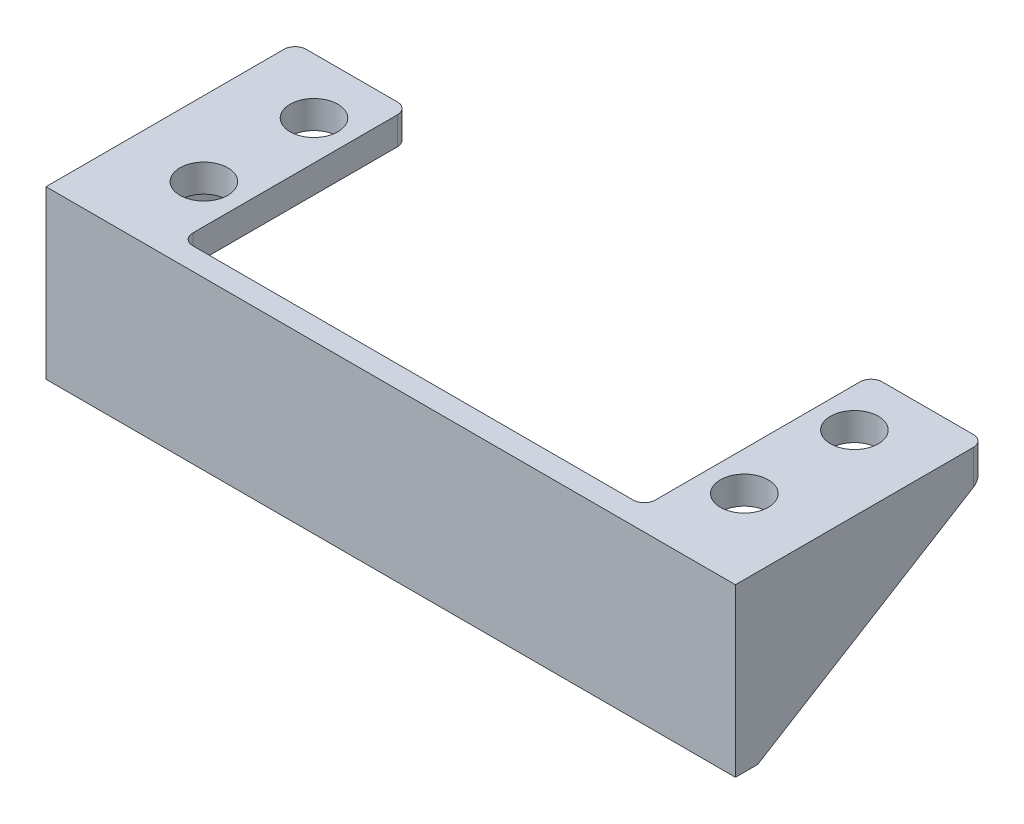
ISO-10303-21;
HEADER;
FILE_DESCRIPTION(('STEP AP214'),'2;1');
FILE_NAME('part.step','',(''),(''),'','','');
FILE_SCHEMA(('AUTOMOTIVE_DESIGN { 1 0 10303 214 1 1 1 1 }'));
ENDSEC;
DATA;
#1=APPLICATION_CONTEXT('core data for automotive mechanical design processes');
#2=APPLICATION_PROTOCOL_DEFINITION('international standard','automotive_design',2000,#1);
#3=PRODUCT_CONTEXT('',#1,'mechanical');
#4=PRODUCT('Part','Part','',(#3));
#5=PRODUCT_RELATED_PRODUCT_CATEGORY('part','',(#4));
#6=PRODUCT_DEFINITION_FORMATION('','',#4);
#7=PRODUCT_DEFINITION_CONTEXT('part definition',#1,'design');
#8=PRODUCT_DEFINITION('design','',#6,#7);
#9=PRODUCT_DEFINITION_SHAPE('','',#8);
#10=(LENGTH_UNIT() NAMED_UNIT(*) SI_UNIT(.MILLI.,.METRE.));
#11=(NAMED_UNIT(*) PLANE_ANGLE_UNIT() SI_UNIT($,.RADIAN.));
#12=(NAMED_UNIT(*) SI_UNIT($,.STERADIAN.) SOLID_ANGLE_UNIT());
#13=UNCERTAINTY_MEASURE_WITH_UNIT(LENGTH_MEASURE(1.E-05),#10,'distance_accuracy_value','');
#14=(GEOMETRIC_REPRESENTATION_CONTEXT(3) GLOBAL_UNCERTAINTY_ASSIGNED_CONTEXT((#13)) GLOBAL_UNIT_ASSIGNED_CONTEXT((#10,
#11,#12)) REPRESENTATION_CONTEXT('',''));
#15=CARTESIAN_POINT('',(0.,0.,0.));
#16=DIRECTION('',(0.,0.,1.));
#17=DIRECTION('',(1.,0.,0.));
#18=AXIS2_PLACEMENT_3D('',#15,#16,#17);
#19=CARTESIAN_POINT('',(0.,0.,0.));
#20=DIRECTION('',(0.,0.,1.));
#21=DIRECTION('',(1.,0.,0.));
#22=AXIS2_PLACEMENT_3D('',#19,#20,#21);
#23=PLANE('',#22);
#24=DIRECTION('',(1.,0.,0.));
#25=VECTOR('',#24,1.);
#26=CARTESIAN_POINT('',(29.,11.5,0.));
#27=LINE('',#26,#25);
#28=CARTESIAN_POINT('',(19.8,11.5,0.));
#29=VERTEX_POINT('',#28);
#30=CARTESIAN_POINT('',(28.,11.5,0.));
#31=VERTEX_POINT('',#30);
#32=EDGE_CURVE('E358',#29,#31,#27,.T.);
#33=ORIENTED_EDGE('',*,*,#32,.T.);
#34=DIRECTION('',(0.,-1.,0.));
#35=VECTOR('',#34,1.);
#36=CARTESIAN_POINT('',(28.,0.,0.));
#37=LINE('',#36,#35);
#38=CARTESIAN_POINT('',(28.,0.,0.));
#39=VERTEX_POINT('',#38);
#40=EDGE_CURVE('E360',#31,#39,#37,.T.);
#41=ORIENTED_EDGE('',*,*,#40,.T.);
#42=DIRECTION('',(1.,0.,0.));
#43=VECTOR('',#42,1.);
#44=CARTESIAN_POINT('',(0.,0.,0.));
#45=LINE('',#44,#43);
#46=CARTESIAN_POINT('',(-28.,0.,0.));
#47=VERTEX_POINT('',#46);
#48=EDGE_CURVE('E197',#47,#39,#45,.T.);
#49=ORIENTED_EDGE('',*,*,#48,.F.);
#50=DIRECTION('',(0.,-1.,0.));
#51=VECTOR('',#50,1.);
#52=CARTESIAN_POINT('',(-28.,12.5,0.));
#53=LINE('',#52,#51);
#54=CARTESIAN_POINT('',(-28.,11.5,0.));
#55=VERTEX_POINT('',#54);
#56=EDGE_CURVE('E308',#47,#55,#53,.F.);
#57=ORIENTED_EDGE('',*,*,#56,.T.);
#58=DIRECTION('',(-1.,0.,0.));
#59=VECTOR('',#58,1.);
#60=CARTESIAN_POINT('',(-20.8,11.5,0.));
#61=LINE('',#60,#59);
#62=CARTESIAN_POINT('',(-19.8,11.5,0.));
#63=VERTEX_POINT('',#62);
#64=EDGE_CURVE('E306',#55,#63,#61,.F.);
#65=ORIENTED_EDGE('',*,*,#64,.T.);
#66=DIRECTION('',(0.,1.,0.));
#67=VECTOR('',#66,1.);
#68=CARTESIAN_POINT('',(-19.8,0.,0.));
#69=LINE('',#68,#67);
#70=CARTESIAN_POINT('',(-19.8,15.,0.));
#71=VERTEX_POINT('',#70);
#72=EDGE_CURVE('E303',#63,#71,#69,.T.);
#73=ORIENTED_EDGE('',*,*,#72,.T.);
#74=DIRECTION('',(-1.,0.,0.));
#75=VECTOR('',#74,1.);
#76=CARTESIAN_POINT('',(0.,15.,0.));
#77=LINE('',#76,#75);
#78=CARTESIAN_POINT('',(19.8,15.,0.));
#79=VERTEX_POINT('',#78);
#80=EDGE_CURVE('E277',#79,#71,#77,.T.);
#81=ORIENTED_EDGE('',*,*,#80,.F.);
#82=DIRECTION('',(0.,1.,0.));
#83=VECTOR('',#82,1.);
#84=CARTESIAN_POINT('',(19.8,12.5,0.));
#85=LINE('',#84,#83);
#86=EDGE_CURVE('E356',#79,#29,#85,.F.);
#87=ORIENTED_EDGE('',*,*,#86,.T.);
#88=EDGE_LOOP('',(#33,#41,#49,#57,#65,#73,#81,#87));
#89=FACE_BOUND('',#88,.T.);
#90=ADVANCED_FACE('F37',(#89),#23,.F.);
#91=CARTESIAN_POINT('',(0.,15.,2.));
#92=DIRECTION('',(0.,-1.,0.));
#93=DIRECTION('',(1.,0.,0.));
#94=AXIS2_PLACEMENT_3D('',#91,#92,#93);
#95=PLANE('',#94);
#96=DIRECTION('',(0.,0.,-1.));
#97=VECTOR('',#96,1.);
#98=CARTESIAN_POINT('',(31.,15.,0.));
#99=LINE('',#98,#97);
#100=CARTESIAN_POINT('',(31.,15.,2.));
#101=VERTEX_POINT('',#100);
#102=CARTESIAN_POINT('',(31.,15.,-19.4));
#103=VERTEX_POINT('',#102);
#104=EDGE_CURVE('E188',#101,#103,#99,.T.);
#105=ORIENTED_EDGE('',*,*,#104,.T.);
#106=CARTESIAN_POINT('',(30.,15.,-19.4));
#107=DIRECTION('',(0.,-1.,0.));
#108=DIRECTION('',(1.,0.,0.));
#109=AXIS2_PLACEMENT_3D('',#106,#107,#108);
#110=CIRCLE('',#109,1.);
#111=CARTESIAN_POINT('',(30.,15.,-20.4));
#112=VERTEX_POINT('',#111);
#113=EDGE_CURVE('E373',#103,#112,#110,.F.);
#114=ORIENTED_EDGE('',*,*,#113,.T.);
#115=DIRECTION('',(-1.,0.,0.));
#116=VECTOR('',#115,1.);
#117=CARTESIAN_POINT('',(0.,15.,-20.4));
#118=LINE('',#117,#116);
#119=CARTESIAN_POINT('',(21.8,15.,-20.4));
#120=VERTEX_POINT('',#119);
#121=EDGE_CURVE('E242',#112,#120,#118,.T.);
#122=ORIENTED_EDGE('',*,*,#121,.T.);
#123=CARTESIAN_POINT('',(21.8,15.,-19.4));
#124=DIRECTION('',(0.,-1.,0.));
#125=DIRECTION('',(1.,0.,0.));
#126=AXIS2_PLACEMENT_3D('',#123,#124,#125);
#127=CIRCLE('',#126,1.);
#128=CARTESIAN_POINT('',(20.8,15.,-19.4));
#129=VERTEX_POINT('',#128);
#130=EDGE_CURVE('E371',#120,#129,#127,.F.);
#131=ORIENTED_EDGE('',*,*,#130,.T.);
#132=DIRECTION('',(0.,0.,-1.));
#133=VECTOR('',#132,1.);
#134=CARTESIAN_POINT('',(20.8,15.,0.));
#135=LINE('',#134,#133);
#136=CARTESIAN_POINT('',(20.8,15.,-1.));
#137=VERTEX_POINT('',#136);
#138=EDGE_CURVE('E228',#137,#129,#135,.T.);
#139=ORIENTED_EDGE('',*,*,#138,.F.);
#140=CARTESIAN_POINT('',(19.8,15.,-1.));
#141=DIRECTION('',(0.,-1.,0.));
#142=DIRECTION('',(1.,0.,0.));
#143=AXIS2_PLACEMENT_3D('',#140,#141,#142);
#144=CIRCLE('',#143,1.);
#145=EDGE_CURVE('E11',#137,#79,#144,.T.);
#146=ORIENTED_EDGE('',*,*,#145,.T.);
#147=ORIENTED_EDGE('',*,*,#80,.T.);
#148=CARTESIAN_POINT('',(-19.8,15.,-1.));
#149=DIRECTION('',(0.,-1.,0.));
#150=DIRECTION('',(1.,0.,0.));
#151=AXIS2_PLACEMENT_3D('',#148,#149,#150);
#152=CIRCLE('',#151,1.);
#153=CARTESIAN_POINT('',(-20.8,15.,-1.));
#154=VERTEX_POINT('',#153);
#155=EDGE_CURVE('E333',#71,#154,#152,.T.);
#156=ORIENTED_EDGE('',*,*,#155,.T.);
#157=DIRECTION('',(0.,0.,-1.));
#158=VECTOR('',#157,1.);
#159=CARTESIAN_POINT('',(-20.8,15.,0.));
#160=LINE('',#159,#158);
#161=CARTESIAN_POINT('',(-20.8,15.,-19.4));
#162=VERTEX_POINT('',#161);
#163=EDGE_CURVE('E283',#154,#162,#160,.T.);
#164=ORIENTED_EDGE('',*,*,#163,.T.);
#165=CARTESIAN_POINT('',(-21.8,15.,-19.4));
#166=DIRECTION('',(0.,-1.,0.));
#167=DIRECTION('',(1.,0.,0.));
#168=AXIS2_PLACEMENT_3D('',#165,#166,#167);
#169=CIRCLE('',#168,1.);
#170=CARTESIAN_POINT('',(-21.8,15.,-20.4));
#171=VERTEX_POINT('',#170);
#172=EDGE_CURVE('E319',#162,#171,#169,.F.);
#173=ORIENTED_EDGE('',*,*,#172,.T.);
#174=DIRECTION('',(1.,0.,0.));
#175=VECTOR('',#174,1.);
#176=CARTESIAN_POINT('',(0.,15.,-20.4));
#177=LINE('',#176,#175);
#178=CARTESIAN_POINT('',(-30.,15.,-20.4));
#179=VERTEX_POINT('',#178);
#180=EDGE_CURVE('E268',#179,#171,#177,.T.);
#181=ORIENTED_EDGE('',*,*,#180,.F.);
#182=CARTESIAN_POINT('',(-30.,15.,-19.4));
#183=DIRECTION('',(0.,-1.,0.));
#184=DIRECTION('',(1.,0.,0.));
#185=AXIS2_PLACEMENT_3D('',#182,#183,#184);
#186=CIRCLE('',#185,1.);
#187=CARTESIAN_POINT('',(-31.,15.,-19.4));
#188=VERTEX_POINT('',#187);
#189=EDGE_CURVE('E321',#179,#188,#186,.F.);
#190=ORIENTED_EDGE('',*,*,#189,.T.);
#191=DIRECTION('',(0.,0.,-1.));
#192=VECTOR('',#191,1.);
#193=CARTESIAN_POINT('',(-31.,15.,0.));
#194=LINE('',#193,#192);
#195=CARTESIAN_POINT('',(-31.,15.,2.));
#196=VERTEX_POINT('',#195);
#197=EDGE_CURVE('E191',#196,#188,#194,.T.);
#198=ORIENTED_EDGE('',*,*,#197,.F.);
#199=DIRECTION('',(-1.,0.,0.));
#200=VECTOR('',#199,1.);
#201=CARTESIAN_POINT('',(0.,15.,2.));
#202=LINE('',#201,#200);
#203=EDGE_CURVE('E184',#101,#196,#202,.T.);
#204=ORIENTED_EDGE('',*,*,#203,.F.);
#205=EDGE_LOOP('',(#105,#114,#122,#131,#139,#146,#147,#156,#164,#173,#181,#190,#198,#204));
#206=FACE_BOUND('',#205,.T.);
#207=CARTESIAN_POINT('',(-24.3,15.,-15.4));
#208=DIRECTION('',(0.,1.,0.));
#209=DIRECTION('',(-1.,0.,0.));
#210=AXIS2_PLACEMENT_3D('',#207,#208,#209);
#211=CIRCLE('',#210,2.15);
#212=CARTESIAN_POINT('',(-26.45,15.,-15.4));
#213=VERTEX_POINT('',#212);
#214=EDGE_CURVE('E263',#213,#213,#211,.T.);
#215=ORIENTED_EDGE('',*,*,#214,.F.);
#216=EDGE_LOOP('',(#215));
#217=FACE_BOUND('',#216,.T.);
#218=CARTESIAN_POINT('',(-24.3,15.,-5.5));
#219=DIRECTION('',(0.,1.,0.));
#220=DIRECTION('',(-1.,0.,0.));
#221=AXIS2_PLACEMENT_3D('',#218,#219,#220);
#222=CIRCLE('',#221,2.15);
#223=CARTESIAN_POINT('',(-26.45,15.,-5.5));
#224=VERTEX_POINT('',#223);
#225=EDGE_CURVE('E280',#224,#224,#222,.T.);
#226=ORIENTED_EDGE('',*,*,#225,.F.);
#227=EDGE_LOOP('',(#226));
#228=FACE_BOUND('',#227,.T.);
#229=CARTESIAN_POINT('',(24.3,15.,-15.4));
#230=DIRECTION('',(0.,-1.,0.));
#231=DIRECTION('',(1.,0.,0.));
#232=AXIS2_PLACEMENT_3D('',#229,#230,#231);
#233=CIRCLE('',#232,2.15);
#234=CARTESIAN_POINT('',(26.45,15.,-15.4));
#235=VERTEX_POINT('',#234);
#236=EDGE_CURVE('E223',#235,#235,#233,.T.);
#237=ORIENTED_EDGE('',*,*,#236,.T.);
#238=EDGE_LOOP('',(#237));
#239=FACE_BOUND('',#238,.T.);
#240=CARTESIAN_POINT('',(24.3,15.,-5.5));
#241=DIRECTION('',(0.,-1.,0.));
#242=DIRECTION('',(1.,0.,0.));
#243=AXIS2_PLACEMENT_3D('',#240,#241,#242);
#244=CIRCLE('',#243,2.15);
#245=CARTESIAN_POINT('',(26.45,15.,-5.5));
#246=VERTEX_POINT('',#245);
#247=EDGE_CURVE('E239',#246,#246,#244,.T.);
#248=ORIENTED_EDGE('',*,*,#247,.T.);
#249=EDGE_LOOP('',(#248));
#250=FACE_BOUND('',#249,.T.);
#251=ADVANCED_FACE('F186',(#206,#217,#228,#239,#250),#95,.F.);
#252=CARTESIAN_POINT('',(0.,0.,2.));
#253=DIRECTION('',(0.,1.,0.));
#254=DIRECTION('',(-1.,0.,0.));
#255=AXIS2_PLACEMENT_3D('',#252,#253,#254);
#256=PLANE('',#255);
#257=DIRECTION('',(1.,0.,0.));
#258=VECTOR('',#257,1.);
#259=CARTESIAN_POINT('',(-31.,0.,0.));
#260=LINE('',#259,#258);
#261=CARTESIAN_POINT('',(-31.,0.,0.));
#262=VERTEX_POINT('',#261);
#263=EDGE_CURVE('E256',#262,#47,#260,.T.);
#264=ORIENTED_EDGE('',*,*,#263,.T.);
#265=ORIENTED_EDGE('',*,*,#48,.T.);
#266=DIRECTION('',(-1.,0.,0.));
#267=VECTOR('',#266,1.);
#268=CARTESIAN_POINT('',(31.,0.,0.));
#269=LINE('',#268,#267);
#270=CARTESIAN_POINT('',(31.,0.,0.));
#271=VERTEX_POINT('',#270);
#272=EDGE_CURVE('E220',#271,#39,#269,.T.);
#273=ORIENTED_EDGE('',*,*,#272,.F.);
#274=DIRECTION('',(0.,0.,1.));
#275=VECTOR('',#274,1.);
#276=CARTESIAN_POINT('',(31.,0.,0.));
#277=LINE('',#276,#275);
#278=CARTESIAN_POINT('',(31.,0.,2.));
#279=VERTEX_POINT('',#278);
#280=EDGE_CURVE('E211',#271,#279,#277,.T.);
#281=ORIENTED_EDGE('',*,*,#280,.T.);
#282=DIRECTION('',(1.,0.,0.));
#283=VECTOR('',#282,1.);
#284=CARTESIAN_POINT('',(0.,0.,2.));
#285=LINE('',#284,#283);
#286=CARTESIAN_POINT('',(-31.,0.,2.));
#287=VERTEX_POINT('',#286);
#288=EDGE_CURVE('E196',#287,#279,#285,.T.);
#289=ORIENTED_EDGE('',*,*,#288,.F.);
#290=DIRECTION('',(0.,0.,1.));
#291=VECTOR('',#290,1.);
#292=CARTESIAN_POINT('',(-31.,0.,0.));
#293=LINE('',#292,#291);
#294=EDGE_CURVE('E249',#262,#287,#293,.T.);
#295=ORIENTED_EDGE('',*,*,#294,.F.);
#296=EDGE_LOOP('',(#264,#265,#273,#281,#289,#295));
#297=FACE_BOUND('',#296,.T.);
#298=ADVANCED_FACE('F436',(#297),#256,.F.);
#299=CARTESIAN_POINT('',(0.,0.,2.));
#300=DIRECTION('',(0.,0.,1.));
#301=DIRECTION('',(1.,0.,0.));
#302=AXIS2_PLACEMENT_3D('',#299,#300,#301);
#303=PLANE('',#302);
#304=ORIENTED_EDGE('',*,*,#288,.T.);
#305=DIRECTION('',(0.,1.,0.));
#306=VECTOR('',#305,1.);
#307=CARTESIAN_POINT('',(31.,0.,2.));
#308=LINE('',#307,#306);
#309=EDGE_CURVE('E204',#279,#101,#308,.T.);
#310=ORIENTED_EDGE('',*,*,#309,.T.);
#311=ORIENTED_EDGE('',*,*,#203,.T.);
#312=DIRECTION('',(0.,1.,0.));
#313=VECTOR('',#312,1.);
#314=CARTESIAN_POINT('',(-31.,0.,2.));
#315=LINE('',#314,#313);
#316=EDGE_CURVE('E253',#287,#196,#315,.T.);
#317=ORIENTED_EDGE('',*,*,#316,.F.);
#318=EDGE_LOOP('',(#304,#310,#311,#317));
#319=FACE_BOUND('',#318,.T.);
#320=ADVANCED_FACE('F210',(#319),#303,.T.);
#321=CARTESIAN_POINT('',(0.,12.5,-20.4));
#322=DIRECTION('',(0.,0.,1.));
#323=DIRECTION('',(1.,0.,0.));
#324=AXIS2_PLACEMENT_3D('',#321,#322,#323);
#325=PLANE('',#324);
#326=DIRECTION('',(1.,0.,0.));
#327=VECTOR('',#326,1.);
#328=CARTESIAN_POINT('',(-31.,12.5,-20.4));
#329=LINE('',#328,#327);
#330=CARTESIAN_POINT('',(-30.,12.5,-20.4));
#331=VERTEX_POINT('',#330);
#332=CARTESIAN_POINT('',(-28.,12.5,-20.4));
#333=VERTEX_POINT('',#332);
#334=EDGE_CURVE('E261',#331,#333,#329,.T.);
#335=ORIENTED_EDGE('',*,*,#334,.F.);
#336=DIRECTION('',(0.,-1.,0.));
#337=VECTOR('',#336,1.);
#338=CARTESIAN_POINT('',(-30.,15.,-20.4));
#339=LINE('',#338,#337);
#340=EDGE_CURVE('E317',#331,#179,#339,.F.);
#341=ORIENTED_EDGE('',*,*,#340,.T.);
#342=ORIENTED_EDGE('',*,*,#180,.T.);
#343=DIRECTION('',(0.,1.,0.));
#344=VECTOR('',#343,1.);
#345=CARTESIAN_POINT('',(-21.8,12.5,-20.4));
#346=LINE('',#345,#344);
#347=CARTESIAN_POINT('',(-21.8,12.5,-20.4));
#348=VERTEX_POINT('',#347);
#349=EDGE_CURVE('E315',#171,#348,#346,.F.);
#350=ORIENTED_EDGE('',*,*,#349,.T.);
#351=DIRECTION('',(1.,0.,0.));
#352=VECTOR('',#351,1.);
#353=CARTESIAN_POINT('',(0.,12.5,-20.4));
#354=LINE('',#353,#352);
#355=EDGE_CURVE('E274',#333,#348,#354,.T.);
#356=ORIENTED_EDGE('',*,*,#355,.F.);
#357=EDGE_LOOP('',(#335,#341,#342,#350,#356));
#358=FACE_BOUND('',#357,.T.);
#359=ADVANCED_FACE('F474',(#358),#325,.F.);
#360=CARTESIAN_POINT('',(-24.3,12.5,-5.5));
#361=DIRECTION('',(0.,1.,0.));
#362=DIRECTION('',(-1.,0.,0.));
#363=AXIS2_PLACEMENT_3D('',#360,#361,#362);
#364=CYLINDRICAL_SURFACE('',#363,2.15);
#365=CARTESIAN_POINT('',(-24.3,12.5,-5.5));
#366=DIRECTION('',(0.,1.,0.));
#367=DIRECTION('',(-1.,0.,0.));
#368=AXIS2_PLACEMENT_3D('',#365,#366,#367);
#369=CIRCLE('',#368,2.15);
#370=CARTESIAN_POINT('',(-26.45,12.5,-5.5));
#371=VERTEX_POINT('',#370);
#372=EDGE_CURVE('E267',#371,#371,#369,.T.);
#373=ORIENTED_EDGE('',*,*,#372,.F.);
#374=EDGE_LOOP('',(#373));
#375=FACE_BOUND('',#374,.T.);
#376=ORIENTED_EDGE('',*,*,#225,.T.);
#377=EDGE_LOOP('',(#376));
#378=FACE_BOUND('',#377,.T.);
#379=ADVANCED_FACE('F711',(#375,#378),#364,.F.);
#380=CARTESIAN_POINT('',(-24.3,12.5,-15.4));
#381=DIRECTION('',(0.,1.,0.));
#382=DIRECTION('',(-1.,0.,0.));
#383=AXIS2_PLACEMENT_3D('',#380,#381,#382);
#384=CYLINDRICAL_SURFACE('',#383,2.15);
#385=CARTESIAN_POINT('',(-24.3,12.5,-15.4));
#386=DIRECTION('',(0.,1.,0.));
#387=DIRECTION('',(-1.,0.,0.));
#388=AXIS2_PLACEMENT_3D('',#385,#386,#387);
#389=CIRCLE('',#388,2.15);
#390=CARTESIAN_POINT('',(-26.45,12.5,-15.4));
#391=VERTEX_POINT('',#390);
#392=EDGE_CURVE('E264',#391,#391,#389,.T.);
#393=ORIENTED_EDGE('',*,*,#392,.F.);
#394=EDGE_LOOP('',(#393));
#395=FACE_BOUND('',#394,.T.);
#396=ORIENTED_EDGE('',*,*,#214,.T.);
#397=EDGE_LOOP('',(#396));
#398=FACE_BOUND('',#397,.T.);
#399=ADVANCED_FACE('F720',(#395,#398),#384,.F.);
#400=CARTESIAN_POINT('',(-20.8,12.5,0.));
#401=DIRECTION('',(1.,0.,0.));
#402=DIRECTION('',(0.,1.,0.));
#403=AXIS2_PLACEMENT_3D('',#400,#401,#402);
#404=PLANE('',#403);
#405=ORIENTED_EDGE('',*,*,#163,.F.);
#406=DIRECTION('',(0.,1.,0.));
#407=VECTOR('',#406,1.);
#408=CARTESIAN_POINT('',(-20.8,12.5,-1.));
#409=LINE('',#408,#407);
#410=CARTESIAN_POINT('',(-20.8,12.5,-1.));
#411=VERTEX_POINT('',#410);
#412=EDGE_CURVE('E326',#154,#411,#409,.F.);
#413=ORIENTED_EDGE('',*,*,#412,.T.);
#414=DIRECTION('',(0.,0.,-1.));
#415=VECTOR('',#414,1.);
#416=CARTESIAN_POINT('',(-20.8,12.5,0.));
#417=LINE('',#416,#415);
#418=CARTESIAN_POINT('',(-20.8,12.5,-19.4));
#419=VERTEX_POINT('',#418);
#420=EDGE_CURVE('E271',#411,#419,#417,.T.);
#421=ORIENTED_EDGE('',*,*,#420,.T.);
#422=DIRECTION('',(0.,1.,0.));
#423=VECTOR('',#422,1.);
#424=CARTESIAN_POINT('',(-20.8,15.,-19.4));
#425=LINE('',#424,#423);
#426=EDGE_CURVE('E323',#419,#162,#425,.T.);
#427=ORIENTED_EDGE('',*,*,#426,.T.);
#428=EDGE_LOOP('',(#405,#413,#421,#427));
#429=FACE_BOUND('',#428,.T.);
#430=ADVANCED_FACE('F463',(#429),#404,.T.);
#431=CARTESIAN_POINT('',(0.,12.5,0.));
#432=DIRECTION('',(0.,1.,0.));
#433=DIRECTION('',(-1.,0.,0.));
#434=AXIS2_PLACEMENT_3D('',#431,#432,#433);
#435=PLANE('',#434);
#436=ORIENTED_EDGE('',*,*,#392,.T.);
#437=EDGE_LOOP('',(#436));
#438=FACE_BOUND('',#437,.T.);
#439=ORIENTED_EDGE('',*,*,#372,.T.);
#440=EDGE_LOOP('',(#439));
#441=FACE_BOUND('',#440,.T.);
#442=DIRECTION('',(-1.,0.,0.));
#443=VECTOR('',#442,1.);
#444=CARTESIAN_POINT('',(-29.,12.5,-1.));
#445=LINE('',#444,#443);
#446=CARTESIAN_POINT('',(-28.,12.5,-1.));
#447=VERTEX_POINT('',#446);
#448=EDGE_CURVE('E294',#411,#447,#445,.T.);
#449=ORIENTED_EDGE('',*,*,#448,.T.);
#450=DIRECTION('',(0.,0.,-1.));
#451=VECTOR('',#450,1.);
#452=CARTESIAN_POINT('',(-28.,12.5,-20.4));
#453=LINE('',#452,#451);
#454=EDGE_CURVE('E296',#447,#333,#453,.T.);
#455=ORIENTED_EDGE('',*,*,#454,.T.);
#456=ORIENTED_EDGE('',*,*,#355,.T.);
#457=CARTESIAN_POINT('',(-21.8,12.5,-19.4));
#458=DIRECTION('',(0.,1.,0.));
#459=DIRECTION('',(-1.,0.,0.));
#460=AXIS2_PLACEMENT_3D('',#457,#458,#459);
#461=CIRCLE('',#460,1.);
#462=EDGE_CURVE('E289',#348,#419,#461,.F.);
#463=ORIENTED_EDGE('',*,*,#462,.T.);
#464=ORIENTED_EDGE('',*,*,#420,.F.);
#465=EDGE_LOOP('',(#449,#455,#456,#463,#464));
#466=FACE_BOUND('',#465,.T.);
#467=ADVANCED_FACE('F491',(#438,#441,#466),#435,.F.);
#468=CARTESIAN_POINT('',(-31.,0.,0.));
#469=DIRECTION('',(0.,0.85266131828619,0.522464043067518));
#470=DIRECTION('',(0.,-0.522464043067518,0.85266131828619));
#471=AXIS2_PLACEMENT_3D('',#468,#469,#470);
#472=PLANE('',#471);
#473=DIRECTION('',(0.,-0.522464043067518,0.85266131828619));
#474=VECTOR('',#473,1.);
#475=CARTESIAN_POINT('',(-31.,0.,0.));
#476=LINE('',#475,#474);
#477=CARTESIAN_POINT('',(-31.,11.8872549019608,-19.4));
#478=VERTEX_POINT('',#477);
#479=EDGE_CURVE('E247',#478,#262,#476,.T.);
#480=ORIENTED_EDGE('',*,*,#479,.F.);
#481=CARTESIAN_POINT('',(-30.,11.8872549019608,-19.4));
#482=DIRECTION('',(0.,0.85266131828619,0.522464043067518));
#483=DIRECTION('',(0.,0.522464043067518,-0.85266131828619));
#484=AXIS2_PLACEMENT_3D('',#481,#482,#483);
#485=ELLIPSE('',#484,1.17279859957756,1.);
#486=EDGE_CURVE('E313',#478,#331,#485,.F.);
#487=ORIENTED_EDGE('',*,*,#486,.T.);
#488=ORIENTED_EDGE('',*,*,#334,.T.);
#489=CARTESIAN_POINT('',(-28.,11.5,-18.768));
#490=DIRECTION('',(0.,0.85266131828619,0.522464043067518));
#491=DIRECTION('',(0.,-0.522464043067518,0.85266131828619));
#492=AXIS2_PLACEMENT_3D('',#489,#490,#491);
#493=ELLIPSE('',#492,1.91400731451058,1.);
#494=CARTESIAN_POINT('',(-29.,11.5,-18.768));
#495=VERTEX_POINT('',#494);
#496=EDGE_CURVE('E328',#333,#495,#493,.T.);
#497=ORIENTED_EDGE('',*,*,#496,.T.);
#498=DIRECTION('',(0.,-0.522464043067518,0.85266131828619));
#499=VECTOR('',#498,1.);
#500=CARTESIAN_POINT('',(-29.,0.,0.));
#501=LINE('',#500,#499);
#502=CARTESIAN_POINT('',(-29.,0.612745098039216,-1.));
#503=VERTEX_POINT('',#502);
#504=EDGE_CURVE('E250',#495,#503,#501,.T.);
#505=ORIENTED_EDGE('',*,*,#504,.T.);
#506=CARTESIAN_POINT('',(-28.,0.612745098039216,-1.));
#507=DIRECTION('',(0.,0.85266131828619,0.522464043067518));
#508=DIRECTION('',(0.,0.522464043067518,-0.85266131828619));
#509=AXIS2_PLACEMENT_3D('',#506,#507,#508);
#510=ELLIPSE('',#509,1.17279859957756,1.);
#511=EDGE_CURVE('E330',#503,#47,#510,.T.);
#512=ORIENTED_EDGE('',*,*,#511,.T.);
#513=ORIENTED_EDGE('',*,*,#263,.F.);
#514=EDGE_LOOP('',(#480,#487,#488,#497,#505,#512,#513));
#515=FACE_BOUND('',#514,.T.);
#516=ADVANCED_FACE('F441',(#515),#472,.F.);
#517=CARTESIAN_POINT('',(-31.,0.,0.));
#518=DIRECTION('',(-1.,0.,0.));
#519=DIRECTION('',(0.,0.,1.));
#520=AXIS2_PLACEMENT_3D('',#517,#518,#519);
#521=PLANE('',#520);
#522=ORIENTED_EDGE('',*,*,#197,.T.);
#523=DIRECTION('',(0.,-1.,0.));
#524=VECTOR('',#523,1.);
#525=CARTESIAN_POINT('',(-31.,12.5,-19.4));
#526=LINE('',#525,#524);
#527=EDGE_CURVE('E310',#188,#478,#526,.T.);
#528=ORIENTED_EDGE('',*,*,#527,.T.);
#529=ORIENTED_EDGE('',*,*,#479,.T.);
#530=ORIENTED_EDGE('',*,*,#294,.T.);
#531=ORIENTED_EDGE('',*,*,#316,.T.);
#532=EDGE_LOOP('',(#522,#528,#529,#530,#531));
#533=FACE_BOUND('',#532,.T.);
#534=ADVANCED_FACE('F481',(#533),#521,.T.);
#535=CARTESIAN_POINT('',(-29.,0.,0.));
#536=DIRECTION('',(-1.,0.,0.));
#537=DIRECTION('',(0.,0.,1.));
#538=AXIS2_PLACEMENT_3D('',#535,#536,#537);
#539=PLANE('',#538);
#540=ORIENTED_EDGE('',*,*,#504,.F.);
#541=DIRECTION('',(0.,0.,-1.));
#542=VECTOR('',#541,1.);
#543=CARTESIAN_POINT('',(-29.,11.5,0.));
#544=LINE('',#543,#542);
#545=CARTESIAN_POINT('',(-29.,11.5,-1.));
#546=VERTEX_POINT('',#545);
#547=EDGE_CURVE('E301',#495,#546,#544,.F.);
#548=ORIENTED_EDGE('',*,*,#547,.T.);
#549=DIRECTION('',(0.,-1.,0.));
#550=VECTOR('',#549,1.);
#551=CARTESIAN_POINT('',(-29.,0.,-1.));
#552=LINE('',#551,#550);
#553=EDGE_CURVE('E299',#546,#503,#552,.T.);
#554=ORIENTED_EDGE('',*,*,#553,.T.);
#555=EDGE_LOOP('',(#540,#548,#554));
#556=FACE_BOUND('',#555,.T.);
#557=ADVANCED_FACE('F483',(#556),#539,.F.);
#558=CARTESIAN_POINT('',(-19.8,0.,-1.));
#559=DIRECTION('',(0.,1.,0.));
#560=DIRECTION('',(-1.,0.,0.));
#561=AXIS2_PLACEMENT_3D('',#558,#559,#560);
#562=CYLINDRICAL_SURFACE('',#561,1.);
#563=ORIENTED_EDGE('',*,*,#155,.F.);
#564=ORIENTED_EDGE('',*,*,#72,.F.);
#565=CARTESIAN_POINT('',(-19.8,11.5,-1.));
#566=DIRECTION('',(0.707106781186547,0.707106781186548,0.));
#567=DIRECTION('',(-0.707106781186548,0.707106781186547,0.));
#568=AXIS2_PLACEMENT_3D('',#565,#566,#567);
#569=ELLIPSE('',#568,1.41421356237309,1.);
#570=EDGE_CURVE('E259',#411,#63,#569,.T.);
#571=ORIENTED_EDGE('',*,*,#570,.F.);
#572=ORIENTED_EDGE('',*,*,#412,.F.);
#573=EDGE_LOOP('',(#563,#564,#571,#572));
#574=FACE_BOUND('',#573,.T.);
#575=ADVANCED_FACE('F460',(#574),#562,.F.);
#576=CARTESIAN_POINT('',(-28.,0.,-1.));
#577=DIRECTION('',(0.,1.,0.));
#578=DIRECTION('',(0.,0.,1.));
#579=AXIS2_PLACEMENT_3D('',#576,#577,#578);
#580=CYLINDRICAL_SURFACE('',#579,1.);
#581=ORIENTED_EDGE('',*,*,#511,.F.);
#582=ORIENTED_EDGE('',*,*,#553,.F.);
#583=CARTESIAN_POINT('',(-28.,11.5,-1.));
#584=DIRECTION('',(0.,-1.,0.));
#585=DIRECTION('',(1.,0.,0.));
#586=AXIS2_PLACEMENT_3D('',#583,#584,#585);
#587=CIRCLE('',#586,1.);
#588=EDGE_CURVE('E341',#55,#546,#587,.T.);
#589=ORIENTED_EDGE('',*,*,#588,.F.);
#590=ORIENTED_EDGE('',*,*,#56,.F.);
#591=EDGE_LOOP('',(#581,#582,#589,#590));
#592=FACE_BOUND('',#591,.T.);
#593=ADVANCED_FACE('F448',(#592),#580,.F.);
#594=CARTESIAN_POINT('',(0.,11.5,-1.));
#595=DIRECTION('',(1.,0.,0.));
#596=DIRECTION('',(0.,1.,0.));
#597=AXIS2_PLACEMENT_3D('',#594,#595,#596);
#598=CYLINDRICAL_SURFACE('',#597,1.);
#599=ORIENTED_EDGE('',*,*,#570,.T.);
#600=ORIENTED_EDGE('',*,*,#64,.F.);
#601=CARTESIAN_POINT('',(-28.,11.5,-1.));
#602=DIRECTION('',(1.,0.,0.));
#603=DIRECTION('',(0.,0.,-1.));
#604=AXIS2_PLACEMENT_3D('',#601,#602,#603);
#605=CIRCLE('',#604,1.);
#606=EDGE_CURVE('E338',#447,#55,#605,.T.);
#607=ORIENTED_EDGE('',*,*,#606,.F.);
#608=ORIENTED_EDGE('',*,*,#448,.F.);
#609=EDGE_LOOP('',(#599,#600,#607,#608));
#610=FACE_BOUND('',#609,.T.);
#611=ADVANCED_FACE('F453',(#610),#598,.F.);
#612=CARTESIAN_POINT('',(-28.,11.5,-1.));
#613=DIRECTION('',(0.,0.,1.));
#614=DIRECTION('',(0.,-1.,0.));
#615=AXIS2_PLACEMENT_3D('',#612,#613,#614);
#616=SPHERICAL_SURFACE('',#615,1.);
#617=ORIENTED_EDGE('',*,*,#606,.T.);
#618=ORIENTED_EDGE('',*,*,#588,.T.);
#619=CARTESIAN_POINT('',(-28.,11.5,-1.));
#620=DIRECTION('',(0.,0.,-1.));
#621=DIRECTION('',(-1.,0.,0.));
#622=AXIS2_PLACEMENT_3D('',#619,#620,#621);
#623=CIRCLE('',#622,1.);
#624=EDGE_CURVE('E236',#447,#546,#623,.F.);
#625=ORIENTED_EDGE('',*,*,#624,.F.);
#626=EDGE_LOOP('',(#617,#618,#625));
#627=FACE_BOUND('',#626,.T.);
#628=ADVANCED_FACE('F508',(#627),#616,.F.);
#629=CARTESIAN_POINT('',(-28.,11.5,0.));
#630=DIRECTION('',(0.,0.,1.));
#631=DIRECTION('',(0.,-1.,0.));
#632=AXIS2_PLACEMENT_3D('',#629,#630,#631);
#633=CYLINDRICAL_SURFACE('',#632,1.);
#634=ORIENTED_EDGE('',*,*,#624,.T.);
#635=ORIENTED_EDGE('',*,*,#547,.F.);
#636=ORIENTED_EDGE('',*,*,#496,.F.);
#637=ORIENTED_EDGE('',*,*,#454,.F.);
#638=EDGE_LOOP('',(#634,#635,#636,#637));
#639=FACE_BOUND('',#638,.T.);
#640=ADVANCED_FACE('F505',(#639),#633,.F.);
#641=CARTESIAN_POINT('',(-30.,0.,-19.4));
#642=DIRECTION('',(0.,1.,0.));
#643=DIRECTION('',(0.,0.,1.));
#644=AXIS2_PLACEMENT_3D('',#641,#642,#643);
#645=CYLINDRICAL_SURFACE('',#644,1.);
#646=ORIENTED_EDGE('',*,*,#189,.F.);
#647=ORIENTED_EDGE('',*,*,#340,.F.);
#648=ORIENTED_EDGE('',*,*,#486,.F.);
#649=ORIENTED_EDGE('',*,*,#527,.F.);
#650=EDGE_LOOP('',(#646,#647,#648,#649));
#651=FACE_BOUND('',#650,.T.);
#652=ADVANCED_FACE('F478',(#651),#645,.T.);
#653=CARTESIAN_POINT('',(-21.8,12.5,-19.4));
#654=DIRECTION('',(0.,-1.,0.));
#655=DIRECTION('',(1.,0.,0.));
#656=AXIS2_PLACEMENT_3D('',#653,#654,#655);
#657=CYLINDRICAL_SURFACE('',#656,1.);
#658=ORIENTED_EDGE('',*,*,#462,.F.);
#659=ORIENTED_EDGE('',*,*,#349,.F.);
#660=ORIENTED_EDGE('',*,*,#172,.F.);
#661=ORIENTED_EDGE('',*,*,#426,.F.);
#662=EDGE_LOOP('',(#658,#659,#660,#661));
#663=FACE_BOUND('',#662,.T.);
#664=ADVANCED_FACE('F468',(#663),#657,.T.);
#665=CARTESIAN_POINT('',(20.8,12.5,0.));
#666=DIRECTION('',(1.,0.,0.));
#667=DIRECTION('',(0.,1.,0.));
#668=AXIS2_PLACEMENT_3D('',#665,#666,#667);
#669=PLANE('',#668);
#670=DIRECTION('',(0.,0.,-1.));
#671=VECTOR('',#670,1.);
#672=CARTESIAN_POINT('',(20.8,12.5,0.));
#673=LINE('',#672,#671);
#674=CARTESIAN_POINT('',(20.8,12.5,-1.));
#675=VERTEX_POINT('',#674);
#676=CARTESIAN_POINT('',(20.8,12.5,-19.4));
#677=VERTEX_POINT('',#676);
#678=EDGE_CURVE('E233',#675,#677,#673,.T.);
#679=ORIENTED_EDGE('',*,*,#678,.F.);
#680=DIRECTION('',(0.,1.,0.));
#681=VECTOR('',#680,1.);
#682=CARTESIAN_POINT('',(20.8,15.,-1.));
#683=LINE('',#682,#681);
#684=EDGE_CURVE('E377',#675,#137,#683,.T.);
#685=ORIENTED_EDGE('',*,*,#684,.T.);
#686=ORIENTED_EDGE('',*,*,#138,.T.);
#687=DIRECTION('',(0.,1.,0.));
#688=VECTOR('',#687,1.);
#689=CARTESIAN_POINT('',(20.8,12.5,-19.4));
#690=LINE('',#689,#688);
#691=EDGE_CURVE('E375',#129,#677,#690,.F.);
#692=ORIENTED_EDGE('',*,*,#691,.T.);
#693=EDGE_LOOP('',(#679,#685,#686,#692));
#694=FACE_BOUND('',#693,.T.);
#695=ADVANCED_FACE('F407',(#694),#669,.F.);
#696=CARTESIAN_POINT('',(0.,12.5,-20.4));
#697=DIRECTION('',(0.,0.,-1.));
#698=DIRECTION('',(-1.,0.,0.));
#699=AXIS2_PLACEMENT_3D('',#696,#697,#698);
#700=PLANE('',#699);
#701=ORIENTED_EDGE('',*,*,#121,.F.);
#702=DIRECTION('',(0.,-1.,0.));
#703=VECTOR('',#702,1.);
#704=CARTESIAN_POINT('',(30.,12.5,-20.4));
#705=LINE('',#704,#703);
#706=CARTESIAN_POINT('',(30.,12.5,-20.4));
#707=VERTEX_POINT('',#706);
#708=EDGE_CURVE('E366',#112,#707,#705,.T.);
#709=ORIENTED_EDGE('',*,*,#708,.T.);
#710=DIRECTION('',(-1.,0.,0.));
#711=VECTOR('',#710,1.);
#712=CARTESIAN_POINT('',(31.,12.5,-20.4));
#713=LINE('',#712,#711);
#714=CARTESIAN_POINT('',(28.,12.5,-20.4));
#715=VERTEX_POINT('',#714);
#716=EDGE_CURVE('E55',#707,#715,#713,.T.);
#717=ORIENTED_EDGE('',*,*,#716,.T.);
#718=DIRECTION('',(-1.,0.,0.));
#719=VECTOR('',#718,1.);
#720=CARTESIAN_POINT('',(0.,12.5,-20.4));
#721=LINE('',#720,#719);
#722=CARTESIAN_POINT('',(21.8,12.5,-20.4));
#723=VERTEX_POINT('',#722);
#724=EDGE_CURVE('E231',#715,#723,#721,.T.);
#725=ORIENTED_EDGE('',*,*,#724,.T.);
#726=DIRECTION('',(0.,1.,0.));
#727=VECTOR('',#726,1.);
#728=CARTESIAN_POINT('',(21.8,15.,-20.4));
#729=LINE('',#728,#727);
#730=EDGE_CURVE('E363',#723,#120,#729,.T.);
#731=ORIENTED_EDGE('',*,*,#730,.T.);
#732=EDGE_LOOP('',(#701,#709,#717,#725,#731));
#733=FACE_BOUND('',#732,.T.);
#734=ADVANCED_FACE('F414',(#733),#700,.T.);
#735=CARTESIAN_POINT('',(24.3,12.5,-5.5));
#736=DIRECTION('',(0.,1.,0.));
#737=DIRECTION('',(-1.,0.,0.));
#738=AXIS2_PLACEMENT_3D('',#735,#736,#737);
#739=CYLINDRICAL_SURFACE('',#738,2.15);
#740=CARTESIAN_POINT('',(24.3,12.5,-5.5));
#741=DIRECTION('',(0.,-1.,0.));
#742=DIRECTION('',(1.,0.,0.));
#743=AXIS2_PLACEMENT_3D('',#740,#741,#742);
#744=CIRCLE('',#743,2.15);
#745=CARTESIAN_POINT('',(26.45,12.5,-5.5));
#746=VERTEX_POINT('',#745);
#747=EDGE_CURVE('E227',#746,#746,#744,.T.);
#748=ORIENTED_EDGE('',*,*,#747,.T.);
#749=EDGE_LOOP('',(#748));
#750=FACE_BOUND('',#749,.T.);
#751=ORIENTED_EDGE('',*,*,#247,.F.);
#752=EDGE_LOOP('',(#751));
#753=FACE_BOUND('',#752,.T.);
#754=ADVANCED_FACE('F557',(#750,#753),#739,.F.);
#755=CARTESIAN_POINT('',(24.3,12.5,-15.4));
#756=DIRECTION('',(0.,1.,0.));
#757=DIRECTION('',(-1.,0.,0.));
#758=AXIS2_PLACEMENT_3D('',#755,#756,#757);
#759=CYLINDRICAL_SURFACE('',#758,2.15);
#760=CARTESIAN_POINT('',(24.3,12.5,-15.4));
#761=DIRECTION('',(0.,-1.,0.));
#762=DIRECTION('',(1.,0.,0.));
#763=AXIS2_PLACEMENT_3D('',#760,#761,#762);
#764=CIRCLE('',#763,2.15);
#765=CARTESIAN_POINT('',(26.45,12.5,-15.4));
#766=VERTEX_POINT('',#765);
#767=EDGE_CURVE('E224',#766,#766,#764,.T.);
#768=ORIENTED_EDGE('',*,*,#767,.T.);
#769=EDGE_LOOP('',(#768));
#770=FACE_BOUND('',#769,.T.);
#771=ORIENTED_EDGE('',*,*,#236,.F.);
#772=EDGE_LOOP('',(#771));
#773=FACE_BOUND('',#772,.T.);
#774=ADVANCED_FACE('F551',(#770,#773),#759,.F.);
#775=CARTESIAN_POINT('',(0.,12.5,0.));
#776=DIRECTION('',(0.,1.,0.));
#777=DIRECTION('',(1.,0.,0.));
#778=AXIS2_PLACEMENT_3D('',#775,#776,#777);
#779=PLANE('',#778);
#780=ORIENTED_EDGE('',*,*,#767,.F.);
#781=EDGE_LOOP('',(#780));
#782=FACE_BOUND('',#781,.T.);
#783=ORIENTED_EDGE('',*,*,#747,.F.);
#784=EDGE_LOOP('',(#783));
#785=FACE_BOUND('',#784,.T.);
#786=ORIENTED_EDGE('',*,*,#724,.F.);
#787=DIRECTION('',(0.,0.,-1.));
#788=VECTOR('',#787,1.);
#789=CARTESIAN_POINT('',(28.,12.5,0.));
#790=LINE('',#789,#788);
#791=CARTESIAN_POINT('',(28.,12.5,-1.));
#792=VERTEX_POINT('',#791);
#793=EDGE_CURVE('E354',#715,#792,#790,.F.);
#794=ORIENTED_EDGE('',*,*,#793,.T.);
#795=DIRECTION('',(1.,0.,0.));
#796=VECTOR('',#795,1.);
#797=CARTESIAN_POINT('',(20.8,12.5,-1.));
#798=LINE('',#797,#796);
#799=EDGE_CURVE('E352',#792,#675,#798,.F.);
#800=ORIENTED_EDGE('',*,*,#799,.T.);
#801=ORIENTED_EDGE('',*,*,#678,.T.);
#802=CARTESIAN_POINT('',(21.8,12.5,-19.4));
#803=DIRECTION('',(0.,1.,0.));
#804=DIRECTION('',(-1.,0.,0.));
#805=AXIS2_PLACEMENT_3D('',#802,#803,#804);
#806=CIRCLE('',#805,1.);
#807=EDGE_CURVE('E350',#677,#723,#806,.F.);
#808=ORIENTED_EDGE('',*,*,#807,.T.);
#809=EDGE_LOOP('',(#786,#794,#800,#801,#808));
#810=FACE_BOUND('',#809,.T.);
#811=ADVANCED_FACE('F417',(#782,#785,#810),#779,.F.);
#812=CARTESIAN_POINT('',(31.,0.,0.));
#813=DIRECTION('',(0.,-0.85266131828619,-0.522464043067518));
#814=DIRECTION('',(0.,0.522464043067518,-0.85266131828619));
#815=AXIS2_PLACEMENT_3D('',#812,#813,#814);
#816=PLANE('',#815);
#817=ORIENTED_EDGE('',*,*,#716,.F.);
#818=CARTESIAN_POINT('',(30.,11.8872549019608,-19.4));
#819=DIRECTION('',(0.,-0.85266131828619,-0.522464043067518));
#820=DIRECTION('',(0.,-0.522464043067518,0.85266131828619));
#821=AXIS2_PLACEMENT_3D('',#818,#819,#820);
#822=ELLIPSE('',#821,1.17279859957756,1.);
#823=CARTESIAN_POINT('',(31.,11.8872549019608,-19.4));
#824=VERTEX_POINT('',#823);
#825=EDGE_CURVE('E368',#707,#824,#822,.T.);
#826=ORIENTED_EDGE('',*,*,#825,.T.);
#827=DIRECTION('',(0.,-0.522464043067518,0.85266131828619));
#828=VECTOR('',#827,1.);
#829=CARTESIAN_POINT('',(31.,0.,0.));
#830=LINE('',#829,#828);
#831=EDGE_CURVE('E213',#824,#271,#830,.T.);
#832=ORIENTED_EDGE('',*,*,#831,.T.);
#833=ORIENTED_EDGE('',*,*,#272,.T.);
#834=CARTESIAN_POINT('',(28.,0.612745098039216,-1.));
#835=DIRECTION('',(0.,-0.85266131828619,-0.522464043067518));
#836=DIRECTION('',(0.,0.522464043067518,-0.85266131828619));
#837=AXIS2_PLACEMENT_3D('',#834,#835,#836);
#838=ELLIPSE('',#837,1.17279859957756,1.);
#839=CARTESIAN_POINT('',(29.,0.612745098039216,-1.));
#840=VERTEX_POINT('',#839);
#841=EDGE_CURVE('E47',#39,#840,#838,.F.);
#842=ORIENTED_EDGE('',*,*,#841,.T.);
#843=DIRECTION('',(0.,-0.522464043067518,0.85266131828619));
#844=VECTOR('',#843,1.);
#845=CARTESIAN_POINT('',(29.,0.,0.));
#846=LINE('',#845,#844);
#847=CARTESIAN_POINT('',(29.,11.5,-18.768));
#848=VERTEX_POINT('',#847);
#849=EDGE_CURVE('E208',#848,#840,#846,.T.);
#850=ORIENTED_EDGE('',*,*,#849,.F.);
#851=CARTESIAN_POINT('',(28.,11.5,-18.768));
#852=DIRECTION('',(0.,-0.85266131828619,-0.522464043067518));
#853=DIRECTION('',(0.,-0.522464043067518,0.85266131828619));
#854=AXIS2_PLACEMENT_3D('',#851,#852,#853);
#855=ELLIPSE('',#854,1.91400731451058,1.);
#856=EDGE_CURVE('E379',#848,#715,#855,.F.);
#857=ORIENTED_EDGE('',*,*,#856,.T.);
#858=EDGE_LOOP('',(#817,#826,#832,#833,#842,#850,#857));
#859=FACE_BOUND('',#858,.T.);
#860=ADVANCED_FACE('F421',(#859),#816,.T.);
#861=CARTESIAN_POINT('',(31.,0.,0.));
#862=DIRECTION('',(1.,0.,0.));
#863=DIRECTION('',(0.,0.,1.));
#864=AXIS2_PLACEMENT_3D('',#861,#862,#863);
#865=PLANE('',#864);
#866=ORIENTED_EDGE('',*,*,#831,.F.);
#867=DIRECTION('',(0.,-1.,0.));
#868=VECTOR('',#867,1.);
#869=CARTESIAN_POINT('',(31.,0.,-19.4));
#870=LINE('',#869,#868);
#871=EDGE_CURVE('E207',#824,#103,#870,.F.);
#872=ORIENTED_EDGE('',*,*,#871,.T.);
#873=ORIENTED_EDGE('',*,*,#104,.F.);
#874=ORIENTED_EDGE('',*,*,#309,.F.);
#875=ORIENTED_EDGE('',*,*,#280,.F.);
#876=EDGE_LOOP('',(#866,#872,#873,#874,#875));
#877=FACE_BOUND('',#876,.T.);
#878=ADVANCED_FACE('F202',(#877),#865,.T.);
#879=CARTESIAN_POINT('',(29.,0.,0.));
#880=DIRECTION('',(1.,0.,0.));
#881=DIRECTION('',(0.,0.,1.));
#882=AXIS2_PLACEMENT_3D('',#879,#880,#881);
#883=PLANE('',#882);
#884=DIRECTION('',(0.,-1.,0.));
#885=VECTOR('',#884,1.);
#886=CARTESIAN_POINT('',(29.,12.5,-1.));
#887=LINE('',#886,#885);
#888=CARTESIAN_POINT('',(29.,11.5,-1.));
#889=VERTEX_POINT('',#888);
#890=EDGE_CURVE('E335',#840,#889,#887,.F.);
#891=ORIENTED_EDGE('',*,*,#890,.T.);
#892=DIRECTION('',(0.,0.,-1.));
#893=VECTOR('',#892,1.);
#894=CARTESIAN_POINT('',(29.,11.5,-20.4));
#895=LINE('',#894,#893);
#896=EDGE_CURVE('E347',#889,#848,#895,.T.);
#897=ORIENTED_EDGE('',*,*,#896,.T.);
#898=ORIENTED_EDGE('',*,*,#849,.T.);
#899=EDGE_LOOP('',(#891,#897,#898));
#900=FACE_BOUND('',#899,.T.);
#901=ADVANCED_FACE('F533',(#900),#883,.F.);
#902=CARTESIAN_POINT('',(19.8,12.5,-1.));
#903=DIRECTION('',(0.,-1.,0.));
#904=DIRECTION('',(1.,0.,0.));
#905=AXIS2_PLACEMENT_3D('',#902,#903,#904);
#906=CYLINDRICAL_SURFACE('',#905,1.);
#907=ORIENTED_EDGE('',*,*,#145,.F.);
#908=ORIENTED_EDGE('',*,*,#684,.F.);
#909=CARTESIAN_POINT('',(19.8,11.5,-1.));
#910=DIRECTION('',(0.707106781186547,-0.707106781186548,0.));
#911=DIRECTION('',(-0.707106781186548,-0.707106781186547,0.));
#912=AXIS2_PLACEMENT_3D('',#909,#910,#911);
#913=ELLIPSE('',#912,1.41421356237309,1.);
#914=EDGE_CURVE('E41',#29,#675,#913,.F.);
#915=ORIENTED_EDGE('',*,*,#914,.F.);
#916=ORIENTED_EDGE('',*,*,#86,.F.);
#917=EDGE_LOOP('',(#907,#908,#915,#916));
#918=FACE_BOUND('',#917,.T.);
#919=ADVANCED_FACE('F403',(#918),#906,.F.);
#920=CARTESIAN_POINT('',(0.,11.5,-1.));
#921=DIRECTION('',(-1.,0.,0.));
#922=DIRECTION('',(0.,-1.,0.));
#923=AXIS2_PLACEMENT_3D('',#920,#921,#922);
#924=CYLINDRICAL_SURFACE('',#923,1.);
#925=ORIENTED_EDGE('',*,*,#914,.T.);
#926=ORIENTED_EDGE('',*,*,#799,.F.);
#927=CARTESIAN_POINT('',(28.,11.5,-1.));
#928=DIRECTION('',(-1.,0.,0.));
#929=DIRECTION('',(0.,0.,1.));
#930=AXIS2_PLACEMENT_3D('',#927,#928,#929);
#931=CIRCLE('',#930,1.);
#932=EDGE_CURVE('E388',#31,#792,#931,.T.);
#933=ORIENTED_EDGE('',*,*,#932,.F.);
#934=ORIENTED_EDGE('',*,*,#32,.F.);
#935=EDGE_LOOP('',(#925,#926,#933,#934));
#936=FACE_BOUND('',#935,.T.);
#937=ADVANCED_FACE('F398',(#936),#924,.F.);
#938=CARTESIAN_POINT('',(28.,0.,-1.));
#939=DIRECTION('',(0.,1.,0.));
#940=DIRECTION('',(0.,0.,1.));
#941=AXIS2_PLACEMENT_3D('',#938,#939,#940);
#942=CYLINDRICAL_SURFACE('',#941,1.);
#943=ORIENTED_EDGE('',*,*,#841,.F.);
#944=ORIENTED_EDGE('',*,*,#40,.F.);
#945=CARTESIAN_POINT('',(28.,11.5,-1.));
#946=DIRECTION('',(0.,-1.,0.));
#947=DIRECTION('',(0.,0.,-1.));
#948=AXIS2_PLACEMENT_3D('',#945,#946,#947);
#949=CIRCLE('',#948,1.);
#950=EDGE_CURVE('E386',#889,#31,#949,.T.);
#951=ORIENTED_EDGE('',*,*,#950,.F.);
#952=ORIENTED_EDGE('',*,*,#890,.F.);
#953=EDGE_LOOP('',(#943,#944,#951,#952));
#954=FACE_BOUND('',#953,.T.);
#955=ADVANCED_FACE('F431',(#954),#942,.F.);
#956=CARTESIAN_POINT('',(28.,11.5,-1.));
#957=DIRECTION('',(0.,0.,1.));
#958=DIRECTION('',(1.,0.,0.));
#959=AXIS2_PLACEMENT_3D('',#956,#957,#958);
#960=SPHERICAL_SURFACE('',#959,1.);
#961=ORIENTED_EDGE('',*,*,#950,.T.);
#962=ORIENTED_EDGE('',*,*,#932,.T.);
#963=CARTESIAN_POINT('',(28.,11.5,-1.));
#964=DIRECTION('',(0.,0.,-1.));
#965=DIRECTION('',(-1.,0.,0.));
#966=AXIS2_PLACEMENT_3D('',#963,#964,#965);
#967=CIRCLE('',#966,1.);
#968=EDGE_CURVE('E383',#889,#792,#967,.F.);
#969=ORIENTED_EDGE('',*,*,#968,.F.);
#970=EDGE_LOOP('',(#961,#962,#969));
#971=FACE_BOUND('',#970,.T.);
#972=ADVANCED_FACE('F425',(#971),#960,.F.);
#973=CARTESIAN_POINT('',(28.,11.5,0.));
#974=DIRECTION('',(0.,0.,1.));
#975=DIRECTION('',(0.,-1.,0.));
#976=AXIS2_PLACEMENT_3D('',#973,#974,#975);
#977=CYLINDRICAL_SURFACE('',#976,1.);
#978=ORIENTED_EDGE('',*,*,#968,.T.);
#979=ORIENTED_EDGE('',*,*,#793,.F.);
#980=ORIENTED_EDGE('',*,*,#856,.F.);
#981=ORIENTED_EDGE('',*,*,#896,.F.);
#982=EDGE_LOOP('',(#978,#979,#980,#981));
#983=FACE_BOUND('',#982,.T.);
#984=ADVANCED_FACE('F424',(#983),#977,.F.);
#985=CARTESIAN_POINT('',(30.,12.5,-19.4));
#986=DIRECTION('',(0.,-1.,0.));
#987=DIRECTION('',(0.,0.,-1.));
#988=AXIS2_PLACEMENT_3D('',#985,#986,#987);
#989=CYLINDRICAL_SURFACE('',#988,1.);
#990=ORIENTED_EDGE('',*,*,#113,.F.);
#991=ORIENTED_EDGE('',*,*,#871,.F.);
#992=ORIENTED_EDGE('',*,*,#825,.F.);
#993=ORIENTED_EDGE('',*,*,#708,.F.);
#994=EDGE_LOOP('',(#990,#991,#992,#993));
#995=FACE_BOUND('',#994,.T.);
#996=ADVANCED_FACE('F525',(#995),#989,.T.);
#997=CARTESIAN_POINT('',(21.8,12.5,-19.4));
#998=DIRECTION('',(0.,-1.,0.));
#999=DIRECTION('',(1.,0.,0.));
#1000=AXIS2_PLACEMENT_3D('',#997,#998,#999);
#1001=CYLINDRICAL_SURFACE('',#1000,1.);
#1002=ORIENTED_EDGE('',*,*,#807,.F.);
#1003=ORIENTED_EDGE('',*,*,#691,.F.);
#1004=ORIENTED_EDGE('',*,*,#130,.F.);
#1005=ORIENTED_EDGE('',*,*,#730,.F.);
#1006=EDGE_LOOP('',(#1002,#1003,#1004,#1005));
#1007=FACE_BOUND('',#1006,.T.);
#1008=ADVANCED_FACE('F39',(#1007),#1001,.T.);
#1009=CLOSED_SHELL('',(#90,#251,#298,#320,#359,#379,#399,#430,#467,#516,#534,#557,#575,#593,
#611,#628,#640,#652,#664,#695,#734,#754,#774,#811,#860,#878,#901,#919,#937,#955,#972,#984,#996,#1008));
#1010=MANIFOLD_SOLID_BREP('B2',#1009);
#1011=ADVANCED_BREP_SHAPE_REPRESENTATION('',(#18,#1010),#14);
#1012=SHAPE_DEFINITION_REPRESENTATION(#9,#1011);
ENDSEC;
END-ISO-10303-21;
